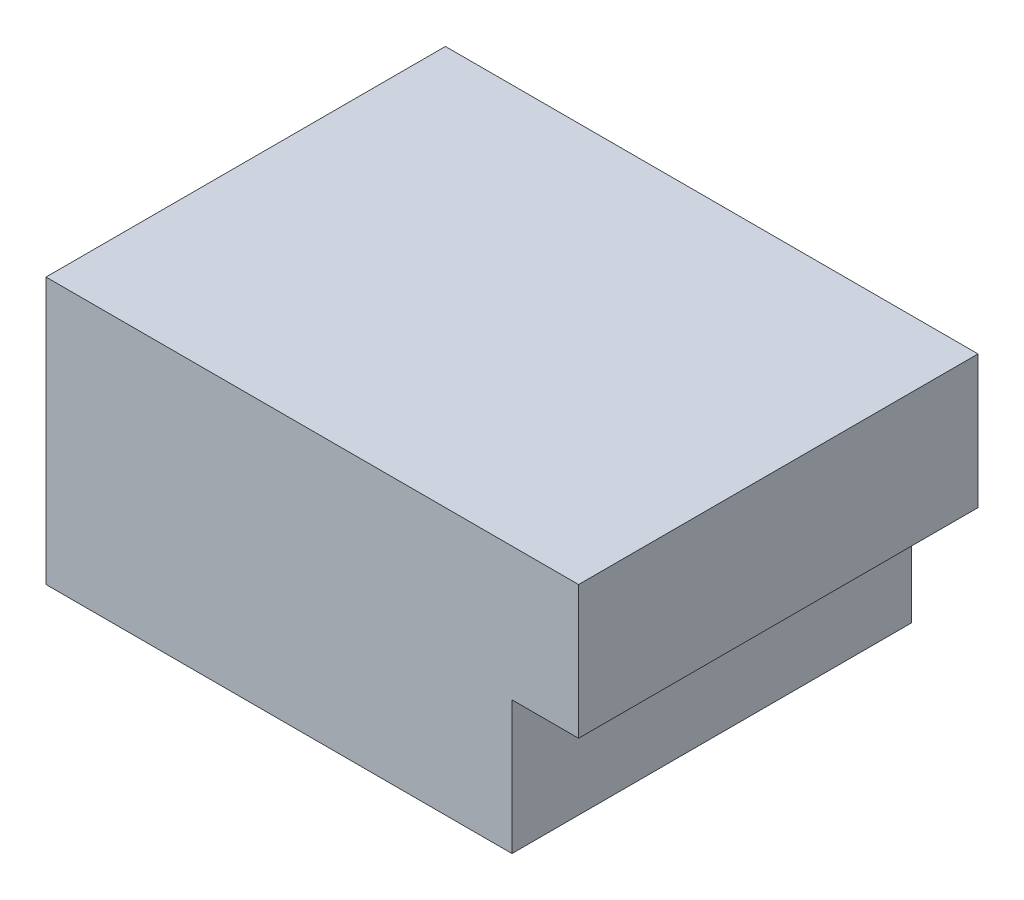
ISO-10303-21;
HEADER;
FILE_DESCRIPTION(('STEP AP214'),'2;1');
FILE_NAME('part.step','',(''),(''),'','','');
FILE_SCHEMA(('AUTOMOTIVE_DESIGN { 1 0 10303 214 1 1 1 1 }'));
ENDSEC;
DATA;
#1=APPLICATION_CONTEXT('core data for automotive mechanical design processes');
#2=APPLICATION_PROTOCOL_DEFINITION('international standard','automotive_design',2000,#1);
#3=PRODUCT_CONTEXT('',#1,'mechanical');
#4=PRODUCT('Part','Part','',(#3));
#5=PRODUCT_RELATED_PRODUCT_CATEGORY('part','',(#4));
#6=PRODUCT_DEFINITION_FORMATION('','',#4);
#7=PRODUCT_DEFINITION_CONTEXT('part definition',#1,'design');
#8=PRODUCT_DEFINITION('design','',#6,#7);
#9=PRODUCT_DEFINITION_SHAPE('','',#8);
#10=(LENGTH_UNIT() NAMED_UNIT(*) SI_UNIT(.MILLI.,.METRE.));
#11=(NAMED_UNIT(*) PLANE_ANGLE_UNIT() SI_UNIT($,.RADIAN.));
#12=(NAMED_UNIT(*) SI_UNIT($,.STERADIAN.) SOLID_ANGLE_UNIT());
#13=UNCERTAINTY_MEASURE_WITH_UNIT(LENGTH_MEASURE(1.E-05),#10,'distance_accuracy_value','');
#14=(GEOMETRIC_REPRESENTATION_CONTEXT(3) GLOBAL_UNCERTAINTY_ASSIGNED_CONTEXT((#13)) GLOBAL_UNIT_ASSIGNED_CONTEXT((#10,
#11,#12)) REPRESENTATION_CONTEXT('',''));
#15=CARTESIAN_POINT('',(0.,0.,0.));
#16=DIRECTION('',(0.,0.,1.));
#17=DIRECTION('',(1.,0.,0.));
#18=AXIS2_PLACEMENT_3D('',#15,#16,#17);
#19=CARTESIAN_POINT('',(0.,0.,0.));
#20=DIRECTION('',(0.,1.,0.));
#21=DIRECTION('',(1.,0.,0.));
#22=AXIS2_PLACEMENT_3D('',#19,#20,#21);
#23=PLANE('',#22);
#24=DIRECTION('',(1.,0.,0.));
#25=VECTOR('',#24,1.);
#26=CARTESIAN_POINT('',(1.6,0.,1.05));
#27=LINE('',#26,#25);
#28=CARTESIAN_POINT('',(1.6,0.,1.05));
#29=VERTEX_POINT('',#28);
#30=CARTESIAN_POINT('',(1.95,0.,1.05));
#31=VERTEX_POINT('',#30);
#32=EDGE_CURVE('E11',#29,#31,#27,.T.);
#33=ORIENTED_EDGE('',*,*,#32,.T.);
#34=DIRECTION('',(0.,0.,-1.));
#35=VECTOR('',#34,1.);
#36=CARTESIAN_POINT('',(1.95,0.,1.35));
#37=LINE('',#36,#35);
#38=CARTESIAN_POINT('',(1.95,0.,1.35));
#39=VERTEX_POINT('',#38);
#40=EDGE_CURVE('E115',#39,#31,#37,.T.);
#41=ORIENTED_EDGE('',*,*,#40,.F.);
#42=DIRECTION('',(-1.,0.,0.));
#43=VECTOR('',#42,1.);
#44=CARTESIAN_POINT('',(1.95,0.,1.35));
#45=LINE('',#44,#43);
#46=CARTESIAN_POINT('',(1.6,0.,1.35));
#47=VERTEX_POINT('',#46);
#48=EDGE_CURVE('E78',#39,#47,#45,.T.);
#49=ORIENTED_EDGE('',*,*,#48,.T.);
#50=DIRECTION('',(0.,0.,1.));
#51=VECTOR('',#50,1.);
#52=CARTESIAN_POINT('',(1.6,0.,1.05));
#53=LINE('',#52,#51);
#54=EDGE_CURVE('E106',#29,#47,#53,.T.);
#55=ORIENTED_EDGE('',*,*,#54,.F.);
#56=EDGE_LOOP('',(#33,#41,#49,#55));
#57=FACE_BOUND('',#56,.T.);
#58=ADVANCED_FACE('F17',(#57),#23,.F.);
#59=CARTESIAN_POINT('',(1.6,0.,1.05));
#60=DIRECTION('',(-1.,0.,0.));
#61=DIRECTION('',(0.,0.,1.));
#62=AXIS2_PLACEMENT_3D('',#59,#60,#61);
#63=PLANE('',#62);
#64=DIRECTION('',(0.,1.,0.));
#65=VECTOR('',#64,1.);
#66=CARTESIAN_POINT('',(1.6,0.,1.35));
#67=LINE('',#66,#65);
#68=CARTESIAN_POINT('',(1.6,0.2,1.35));
#69=VERTEX_POINT('',#68);
#70=EDGE_CURVE('E24',#47,#69,#67,.T.);
#71=ORIENTED_EDGE('',*,*,#70,.T.);
#72=DIRECTION('',(0.,0.,-1.));
#73=VECTOR('',#72,1.);
#74=CARTESIAN_POINT('',(1.6,0.2,1.35));
#75=LINE('',#74,#73);
#76=CARTESIAN_POINT('',(1.6,0.2,1.05));
#77=VERTEX_POINT('',#76);
#78=EDGE_CURVE('E91',#69,#77,#75,.T.);
#79=ORIENTED_EDGE('',*,*,#78,.T.);
#80=DIRECTION('',(0.,1.,0.));
#81=VECTOR('',#80,1.);
#82=CARTESIAN_POINT('',(1.6,0.,1.05));
#83=LINE('',#82,#81);
#84=EDGE_CURVE('E108',#29,#77,#83,.T.);
#85=ORIENTED_EDGE('',*,*,#84,.F.);
#86=ORIENTED_EDGE('',*,*,#54,.T.);
#87=EDGE_LOOP('',(#71,#79,#85,#86));
#88=FACE_BOUND('',#87,.T.);
#89=ADVANCED_FACE('F122',(#88),#63,.T.);
#90=CARTESIAN_POINT('',(2.,0.,1.05));
#91=DIRECTION('',(0.,0.,-1.));
#92=DIRECTION('',(-1.,0.,0.));
#93=AXIS2_PLACEMENT_3D('',#90,#91,#92);
#94=PLANE('',#93);
#95=DIRECTION('',(0.,1.,0.));
#96=VECTOR('',#95,1.);
#97=CARTESIAN_POINT('',(2.,0.1,1.05));
#98=LINE('',#97,#96);
#99=CARTESIAN_POINT('',(2.,0.1,1.05));
#100=VERTEX_POINT('',#99);
#101=CARTESIAN_POINT('',(2.,0.2,1.05));
#102=VERTEX_POINT('',#101);
#103=EDGE_CURVE('E73',#100,#102,#98,.T.);
#104=ORIENTED_EDGE('',*,*,#103,.F.);
#105=DIRECTION('',(-1.,0.,0.));
#106=VECTOR('',#105,1.);
#107=CARTESIAN_POINT('',(2.,0.1,1.05));
#108=LINE('',#107,#106);
#109=CARTESIAN_POINT('',(1.95,0.1,1.05));
#110=VERTEX_POINT('',#109);
#111=EDGE_CURVE('E79',#100,#110,#108,.T.);
#112=ORIENTED_EDGE('',*,*,#111,.T.);
#113=DIRECTION('',(0.,1.,0.));
#114=VECTOR('',#113,1.);
#115=CARTESIAN_POINT('',(1.95,0.,1.05));
#116=LINE('',#115,#114);
#117=EDGE_CURVE('E99',#31,#110,#116,.T.);
#118=ORIENTED_EDGE('',*,*,#117,.F.);
#119=ORIENTED_EDGE('',*,*,#32,.F.);
#120=ORIENTED_EDGE('',*,*,#84,.T.);
#121=DIRECTION('',(1.,0.,0.));
#122=VECTOR('',#121,1.);
#123=CARTESIAN_POINT('',(1.6,0.2,1.05));
#124=LINE('',#123,#122);
#125=EDGE_CURVE('E102',#77,#102,#124,.T.);
#126=ORIENTED_EDGE('',*,*,#125,.T.);
#127=EDGE_LOOP('',(#104,#112,#118,#119,#120,#126));
#128=FACE_BOUND('',#127,.T.);
#129=ADVANCED_FACE('F124',(#128),#94,.T.);
#130=CARTESIAN_POINT('',(0.,0.2,0.));
#131=DIRECTION('',(0.,1.,0.));
#132=DIRECTION('',(1.,0.,0.));
#133=AXIS2_PLACEMENT_3D('',#130,#131,#132);
#134=PLANE('',#133);
#135=DIRECTION('',(0.,0.,-1.));
#136=VECTOR('',#135,1.);
#137=CARTESIAN_POINT('',(2.,0.2,1.35));
#138=LINE('',#137,#136);
#139=CARTESIAN_POINT('',(2.,0.2,1.35));
#140=VERTEX_POINT('',#139);
#141=EDGE_CURVE('E68',#140,#102,#138,.T.);
#142=ORIENTED_EDGE('',*,*,#141,.T.);
#143=ORIENTED_EDGE('',*,*,#125,.F.);
#144=ORIENTED_EDGE('',*,*,#78,.F.);
#145=DIRECTION('',(-1.,0.,0.));
#146=VECTOR('',#145,1.);
#147=CARTESIAN_POINT('',(2.,0.2,1.35));
#148=LINE('',#147,#146);
#149=EDGE_CURVE('E84',#140,#69,#148,.T.);
#150=ORIENTED_EDGE('',*,*,#149,.F.);
#151=EDGE_LOOP('',(#142,#143,#144,#150));
#152=FACE_BOUND('',#151,.T.);
#153=ADVANCED_FACE('F90',(#152),#134,.T.);
#154=CARTESIAN_POINT('',(1.75,0.,1.35));
#155=DIRECTION('',(0.,0.,1.));
#156=DIRECTION('',(1.,0.,0.));
#157=AXIS2_PLACEMENT_3D('',#154,#155,#156);
#158=PLANE('',#157);
#159=DIRECTION('',(0.,1.,0.));
#160=VECTOR('',#159,1.);
#161=CARTESIAN_POINT('',(1.95,0.,1.35));
#162=LINE('',#161,#160);
#163=CARTESIAN_POINT('',(1.95,0.1,1.35));
#164=VERTEX_POINT('',#163);
#165=EDGE_CURVE('E104',#39,#164,#162,.T.);
#166=ORIENTED_EDGE('',*,*,#165,.T.);
#167=DIRECTION('',(-1.,0.,0.));
#168=VECTOR('',#167,1.);
#169=CARTESIAN_POINT('',(2.,0.1,1.35));
#170=LINE('',#169,#168);
#171=CARTESIAN_POINT('',(2.,0.1,1.35));
#172=VERTEX_POINT('',#171);
#173=EDGE_CURVE('E86',#172,#164,#170,.T.);
#174=ORIENTED_EDGE('',*,*,#173,.F.);
#175=DIRECTION('',(0.,1.,0.));
#176=VECTOR('',#175,1.);
#177=CARTESIAN_POINT('',(2.,0.1,1.35));
#178=LINE('',#177,#176);
#179=EDGE_CURVE('E72',#172,#140,#178,.T.);
#180=ORIENTED_EDGE('',*,*,#179,.T.);
#181=ORIENTED_EDGE('',*,*,#149,.T.);
#182=ORIENTED_EDGE('',*,*,#70,.F.);
#183=ORIENTED_EDGE('',*,*,#48,.F.);
#184=EDGE_LOOP('',(#166,#174,#180,#181,#182,#183));
#185=FACE_BOUND('',#184,.T.);
#186=ADVANCED_FACE('F83',(#185),#158,.T.);
#187=CARTESIAN_POINT('',(2.,0.,1.35));
#188=DIRECTION('',(1.,0.,0.));
#189=DIRECTION('',(0.,0.,-1.));
#190=AXIS2_PLACEMENT_3D('',#187,#188,#189);
#191=PLANE('',#190);
#192=ORIENTED_EDGE('',*,*,#103,.T.);
#193=ORIENTED_EDGE('',*,*,#141,.F.);
#194=ORIENTED_EDGE('',*,*,#179,.F.);
#195=DIRECTION('',(0.,0.,-1.));
#196=VECTOR('',#195,1.);
#197=CARTESIAN_POINT('',(2.,0.1,1.35));
#198=LINE('',#197,#196);
#199=EDGE_CURVE('E88',#172,#100,#198,.T.);
#200=ORIENTED_EDGE('',*,*,#199,.T.);
#201=EDGE_LOOP('',(#192,#193,#194,#200));
#202=FACE_BOUND('',#201,.T.);
#203=ADVANCED_FACE('F70',(#202),#191,.T.);
#204=CARTESIAN_POINT('',(2.,0.1,-1.92));
#205=DIRECTION('',(0.,1.,0.));
#206=DIRECTION('',(-1.,0.,0.));
#207=AXIS2_PLACEMENT_3D('',#204,#205,#206);
#208=PLANE('',#207);
#209=ORIENTED_EDGE('',*,*,#199,.F.);
#210=ORIENTED_EDGE('',*,*,#173,.T.);
#211=DIRECTION('',(0.,0.,1.));
#212=VECTOR('',#211,1.);
#213=CARTESIAN_POINT('',(1.95,0.1,1.05));
#214=LINE('',#213,#212);
#215=EDGE_CURVE('E92',#110,#164,#214,.T.);
#216=ORIENTED_EDGE('',*,*,#215,.F.);
#217=ORIENTED_EDGE('',*,*,#111,.F.);
#218=EDGE_LOOP('',(#209,#210,#216,#217));
#219=FACE_BOUND('',#218,.T.);
#220=ADVANCED_FACE('F127',(#219),#208,.F.);
#221=CARTESIAN_POINT('',(1.95,0.1,-1.92));
#222=DIRECTION('',(-1.,0.,0.));
#223=DIRECTION('',(0.,-1.,0.));
#224=AXIS2_PLACEMENT_3D('',#221,#222,#223);
#225=PLANE('',#224);
#226=ORIENTED_EDGE('',*,*,#117,.T.);
#227=ORIENTED_EDGE('',*,*,#215,.T.);
#228=ORIENTED_EDGE('',*,*,#165,.F.);
#229=ORIENTED_EDGE('',*,*,#40,.T.);
#230=EDGE_LOOP('',(#226,#227,#228,#229));
#231=FACE_BOUND('',#230,.T.);
#232=ADVANCED_FACE('F119',(#231),#225,.F.);
#233=CLOSED_SHELL('',(#58,#89,#129,#153,#186,#203,#220,#232));
#234=MANIFOLD_SOLID_BREP('B1',#233);
#235=ADVANCED_BREP_SHAPE_REPRESENTATION('',(#18,#234),#14);
#236=SHAPE_DEFINITION_REPRESENTATION(#9,#235);
ENDSEC;
END-ISO-10303-21;
